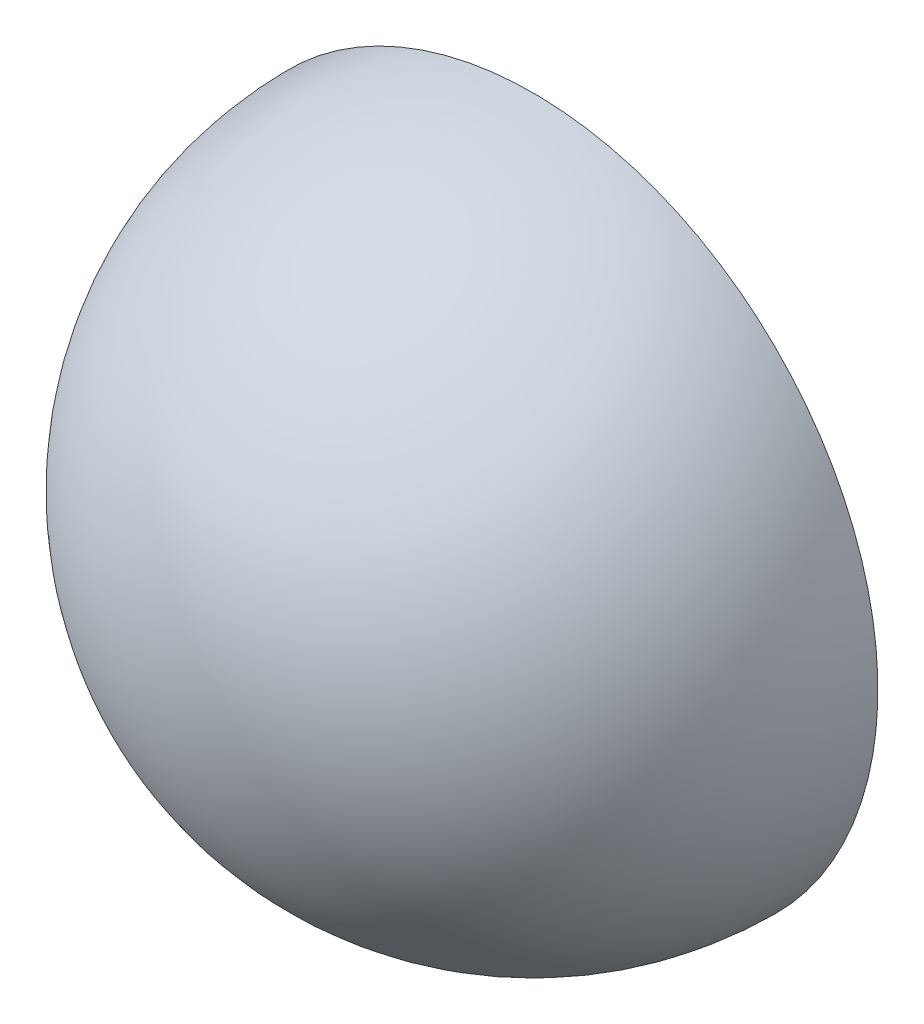
ISO-10303-21;
HEADER;
FILE_DESCRIPTION(('STEP AP214'),'2;1');
FILE_NAME('part.step','',(''),(''),'','','');
FILE_SCHEMA(('AUTOMOTIVE_DESIGN { 1 0 10303 214 1 1 1 1 }'));
ENDSEC;
DATA;
#1=APPLICATION_CONTEXT('core data for automotive mechanical design processes');
#2=APPLICATION_PROTOCOL_DEFINITION('international standard','automotive_design',2000,#1);
#3=PRODUCT_CONTEXT('',#1,'mechanical');
#4=PRODUCT('Part','Part','',(#3));
#5=PRODUCT_RELATED_PRODUCT_CATEGORY('part','',(#4));
#6=PRODUCT_DEFINITION_FORMATION('','',#4);
#7=PRODUCT_DEFINITION_CONTEXT('part definition',#1,'design');
#8=PRODUCT_DEFINITION('design','',#6,#7);
#9=PRODUCT_DEFINITION_SHAPE('','',#8);
#10=(LENGTH_UNIT() NAMED_UNIT(*) SI_UNIT(.MILLI.,.METRE.));
#11=(NAMED_UNIT(*) PLANE_ANGLE_UNIT() SI_UNIT($,.RADIAN.));
#12=(NAMED_UNIT(*) SI_UNIT($,.STERADIAN.) SOLID_ANGLE_UNIT());
#13=UNCERTAINTY_MEASURE_WITH_UNIT(LENGTH_MEASURE(1.E-05),#10,'distance_accuracy_value','');
#14=(GEOMETRIC_REPRESENTATION_CONTEXT(3) GLOBAL_UNCERTAINTY_ASSIGNED_CONTEXT((#13)) GLOBAL_UNIT_ASSIGNED_CONTEXT((#10,
#11,#12)) REPRESENTATION_CONTEXT('',''));
#15=CARTESIAN_POINT('',(0.,0.,0.));
#16=DIRECTION('',(0.,0.,1.));
#17=DIRECTION('',(1.,0.,0.));
#18=AXIS2_PLACEMENT_3D('',#15,#16,#17);
#19=CARTESIAN_POINT('',(0.,0.,0.));
#20=DIRECTION('',(0.,1.,0.));
#21=DIRECTION('',(-1.,0.,0.));
#22=AXIS2_PLACEMENT_3D('',#19,#20,#21);
#23=SPHERICAL_SURFACE('',#22,5.);
#24=CARTESIAN_POINT('',(0.,0.,0.));
#25=DIRECTION('',(0.,0.,-1.));
#26=DIRECTION('',(-1.,0.,0.));
#27=AXIS2_PLACEMENT_3D('',#24,#25,#26);
#28=SPHERICAL_SURFACE('',#27,5.);
#29=CARTESIAN_POINT('',(0.,0.,0.));
#30=DIRECTION('',(0.,0.,-1.));
#31=DIRECTION('',(-1.,0.,0.));
#32=AXIS2_PLACEMENT_3D('',#29,#30,#31);
#33=CIRCLE('',#32,5.);
#34=CARTESIAN_POINT('',(-5.,0.,0.));
#35=VERTEX_POINT('',#34);
#36=EDGE_CURVE('E10',#35,#35,#33,.T.);
#37=ORIENTED_EDGE('',*,*,#36,.F.);
#38=EDGE_LOOP('',(#37));
#39=FACE_BOUND('',#38,.T.);
#40=ADVANCED_FACE('F30',(#39),#28,.T.);
#41=CARTESIAN_POINT('',(0.,0.,0.));
#42=DIRECTION('',(0.,0.,-1.));
#43=DIRECTION('',(-1.,0.,0.));
#44=AXIS2_PLACEMENT_3D('',#41,#42,#43);
#45=PLANE('',#44);
#46=ORIENTED_EDGE('',*,*,#36,.T.);
#47=EDGE_LOOP('',(#46));
#48=FACE_BOUND('',#47,.T.);
#49=ADVANCED_FACE('F37',(#48),#45,.T.);
#50=CLOSED_SHELL('',(#40,#49));
#51=MANIFOLD_SOLID_BREP('B2',#50);
#52=ADVANCED_BREP_SHAPE_REPRESENTATION('',(#18,#51),#14);
#53=SHAPE_DEFINITION_REPRESENTATION(#9,#52);
ENDSEC;
END-ISO-10303-21;
